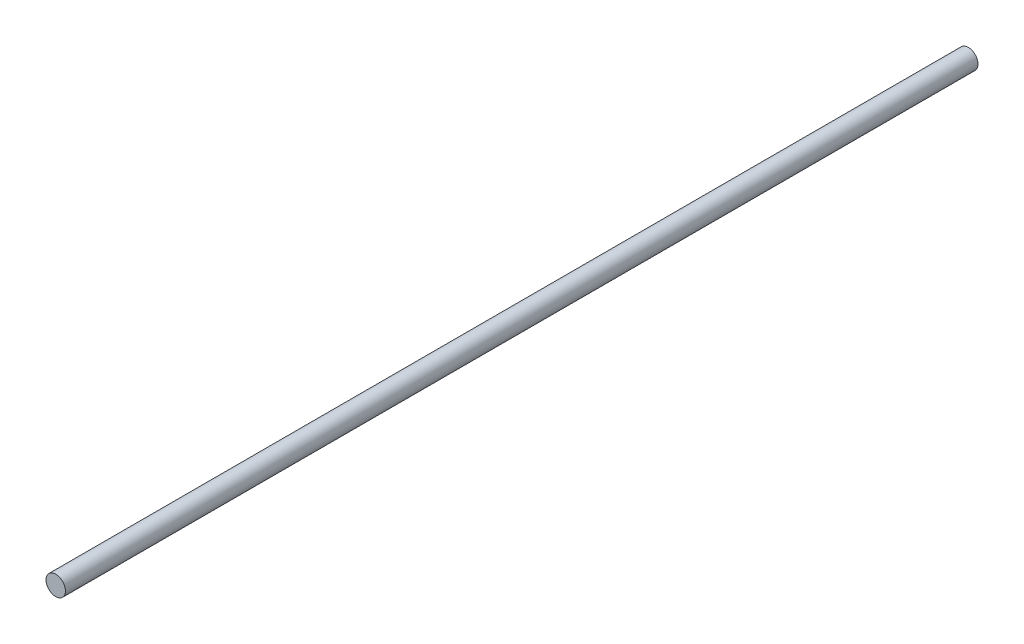
ISO-10303-21;
HEADER;
FILE_DESCRIPTION(('STEP AP214'),'2;1');
FILE_NAME('part.step','',(''),(''),'','','');
FILE_SCHEMA(('AUTOMOTIVE_DESIGN { 1 0 10303 214 1 1 1 1 }'));
ENDSEC;
DATA;
#1=APPLICATION_CONTEXT('core data for automotive mechanical design processes');
#2=APPLICATION_PROTOCOL_DEFINITION('international standard','automotive_design',2000,#1);
#3=PRODUCT_CONTEXT('',#1,'mechanical');
#4=PRODUCT('Part','Part','',(#3));
#5=PRODUCT_RELATED_PRODUCT_CATEGORY('part','',(#4));
#6=PRODUCT_DEFINITION_FORMATION('','',#4);
#7=PRODUCT_DEFINITION_CONTEXT('part definition',#1,'design');
#8=PRODUCT_DEFINITION('design','',#6,#7);
#9=PRODUCT_DEFINITION_SHAPE('','',#8);
#10=(LENGTH_UNIT() NAMED_UNIT(*) SI_UNIT(.MILLI.,.METRE.));
#11=(NAMED_UNIT(*) PLANE_ANGLE_UNIT() SI_UNIT($,.RADIAN.));
#12=(NAMED_UNIT(*) SI_UNIT($,.STERADIAN.) SOLID_ANGLE_UNIT());
#13=UNCERTAINTY_MEASURE_WITH_UNIT(LENGTH_MEASURE(1.E-05),#10,'distance_accuracy_value','');
#14=(GEOMETRIC_REPRESENTATION_CONTEXT(3) GLOBAL_UNCERTAINTY_ASSIGNED_CONTEXT((#13)) GLOBAL_UNIT_ASSIGNED_CONTEXT((#10,
#11,#12)) REPRESENTATION_CONTEXT('',''));
#15=CARTESIAN_POINT('',(0.,0.,0.));
#16=DIRECTION('',(0.,0.,1.));
#17=DIRECTION('',(1.,0.,0.));
#18=AXIS2_PLACEMENT_3D('',#15,#16,#17);
#19=CARTESIAN_POINT('',(0.,0.,375.));
#20=DIRECTION('',(0.,0.,-1.));
#21=DIRECTION('',(-1.,0.,0.));
#22=AXIS2_PLACEMENT_3D('',#19,#20,#21);
#23=CYLINDRICAL_SURFACE('',#22,4.);
#24=CARTESIAN_POINT('',(0.,0.,375.));
#25=DIRECTION('',(0.,0.,1.));
#26=DIRECTION('',(1.,0.,0.));
#27=AXIS2_PLACEMENT_3D('',#24,#25,#26);
#28=CIRCLE('',#27,4.);
#29=CARTESIAN_POINT('',(4.,0.,375.));
#30=VERTEX_POINT('',#29);
#31=EDGE_CURVE('E10',#30,#30,#28,.T.);
#32=ORIENTED_EDGE('',*,*,#31,.F.);
#33=EDGE_LOOP('',(#32));
#34=FACE_BOUND('',#33,.T.);
#35=CARTESIAN_POINT('',(0.,0.,0.));
#36=DIRECTION('',(0.,0.,1.));
#37=DIRECTION('',(1.,0.,0.));
#38=AXIS2_PLACEMENT_3D('',#35,#36,#37);
#39=CIRCLE('',#38,4.);
#40=CARTESIAN_POINT('',(4.,0.,0.));
#41=VERTEX_POINT('',#40);
#42=EDGE_CURVE('E37',#41,#41,#39,.T.);
#43=ORIENTED_EDGE('',*,*,#42,.T.);
#44=EDGE_LOOP('',(#43));
#45=FACE_BOUND('',#44,.T.);
#46=ADVANCED_FACE('F34',(#34,#45),#23,.T.);
#47=CARTESIAN_POINT('',(0.,0.,375.));
#48=DIRECTION('',(0.,0.,1.));
#49=DIRECTION('',(1.,0.,0.));
#50=AXIS2_PLACEMENT_3D('',#47,#48,#49);
#51=PLANE('',#50);
#52=ORIENTED_EDGE('',*,*,#31,.T.);
#53=EDGE_LOOP('',(#52));
#54=FACE_BOUND('',#53,.T.);
#55=ADVANCED_FACE('F49',(#54),#51,.T.);
#56=CARTESIAN_POINT('',(0.,0.,0.));
#57=DIRECTION('',(0.,0.,1.));
#58=DIRECTION('',(1.,0.,0.));
#59=AXIS2_PLACEMENT_3D('',#56,#57,#58);
#60=PLANE('',#59);
#61=ORIENTED_EDGE('',*,*,#42,.F.);
#62=EDGE_LOOP('',(#61));
#63=FACE_BOUND('',#62,.T.);
#64=ADVANCED_FACE('F47',(#63),#60,.F.);
#65=CLOSED_SHELL('',(#46,#55,#64));
#66=MANIFOLD_SOLID_BREP('B2',#65);
#67=ADVANCED_BREP_SHAPE_REPRESENTATION('',(#18,#66),#14);
#68=SHAPE_DEFINITION_REPRESENTATION(#9,#67);
ENDSEC;
END-ISO-10303-21;
